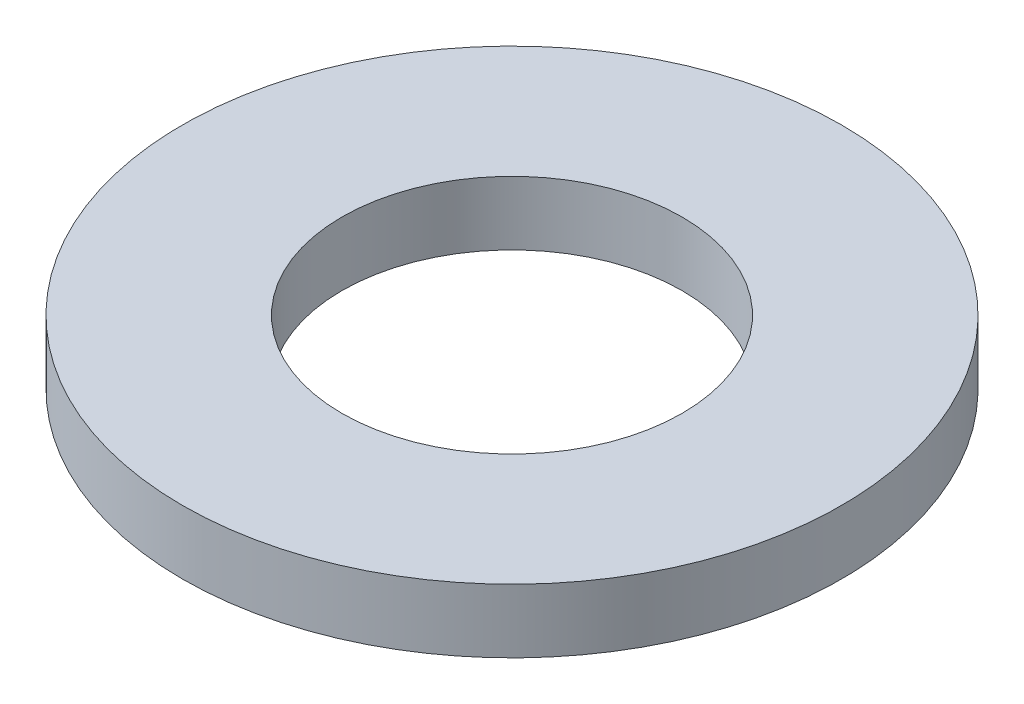
ISO-10303-21;
HEADER;
FILE_DESCRIPTION(('STEP AP214'),'2;1');
FILE_NAME('part.step','',(''),(''),'','','');
FILE_SCHEMA(('AUTOMOTIVE_DESIGN { 1 0 10303 214 1 1 1 1 }'));
ENDSEC;
DATA;
#1=APPLICATION_CONTEXT('core data for automotive mechanical design processes');
#2=APPLICATION_PROTOCOL_DEFINITION('international standard','automotive_design',2000,#1);
#3=PRODUCT_CONTEXT('',#1,'mechanical');
#4=PRODUCT('Part','Part','',(#3));
#5=PRODUCT_RELATED_PRODUCT_CATEGORY('part','',(#4));
#6=PRODUCT_DEFINITION_FORMATION('','',#4);
#7=PRODUCT_DEFINITION_CONTEXT('part definition',#1,'design');
#8=PRODUCT_DEFINITION('design','',#6,#7);
#9=PRODUCT_DEFINITION_SHAPE('','',#8);
#10=(LENGTH_UNIT() NAMED_UNIT(*) SI_UNIT(.MILLI.,.METRE.));
#11=(NAMED_UNIT(*) PLANE_ANGLE_UNIT() SI_UNIT($,.RADIAN.));
#12=(NAMED_UNIT(*) SI_UNIT($,.STERADIAN.) SOLID_ANGLE_UNIT());
#13=UNCERTAINTY_MEASURE_WITH_UNIT(LENGTH_MEASURE(1.E-05),#10,'distance_accuracy_value','');
#14=(GEOMETRIC_REPRESENTATION_CONTEXT(3) GLOBAL_UNCERTAINTY_ASSIGNED_CONTEXT((#13)) GLOBAL_UNIT_ASSIGNED_CONTEXT((#10,
#11,#12)) REPRESENTATION_CONTEXT('',''));
#15=CARTESIAN_POINT('',(0.,0.,0.));
#16=DIRECTION('',(0.,0.,1.));
#17=DIRECTION('',(1.,0.,0.));
#18=AXIS2_PLACEMENT_3D('',#15,#16,#17);
#19=CARTESIAN_POINT('',(0.,15.,0.));
#20=DIRECTION('',(0.,-1.,0.));
#21=DIRECTION('',(0.,0.,-1.));
#22=AXIS2_PLACEMENT_3D('',#19,#20,#21);
#23=CYLINDRICAL_SURFACE('',#22,77.5);
#24=CARTESIAN_POINT('',(0.,15.,0.));
#25=DIRECTION('',(0.,1.,0.));
#26=DIRECTION('',(0.,0.,1.));
#27=AXIS2_PLACEMENT_3D('',#24,#25,#26);
#28=CIRCLE('',#27,77.5);
#29=CARTESIAN_POINT('',(0.,15.,77.5));
#30=VERTEX_POINT('',#29);
#31=EDGE_CURVE('E10',#30,#30,#28,.T.);
#32=ORIENTED_EDGE('',*,*,#31,.F.);
#33=EDGE_LOOP('',(#32));
#34=FACE_BOUND('',#33,.T.);
#35=CARTESIAN_POINT('',(0.,0.,0.));
#36=DIRECTION('',(0.,1.,0.));
#37=DIRECTION('',(0.,0.,1.));
#38=AXIS2_PLACEMENT_3D('',#35,#36,#37);
#39=CIRCLE('',#38,77.5);
#40=CARTESIAN_POINT('',(0.,0.,77.5));
#41=VERTEX_POINT('',#40);
#42=EDGE_CURVE('E37',#41,#41,#39,.T.);
#43=ORIENTED_EDGE('',*,*,#42,.T.);
#44=EDGE_LOOP('',(#43));
#45=FACE_BOUND('',#44,.T.);
#46=ADVANCED_FACE('F40',(#34,#45),#23,.T.);
#47=CARTESIAN_POINT('',(0.,15.,0.));
#48=DIRECTION('',(0.,1.,0.));
#49=DIRECTION('',(0.,0.,1.));
#50=AXIS2_PLACEMENT_3D('',#47,#48,#49);
#51=PLANE('',#50);
#52=CARTESIAN_POINT('',(0.,15.,0.));
#53=DIRECTION('',(0.,1.,0.));
#54=DIRECTION('',(0.,0.,1.));
#55=AXIS2_PLACEMENT_3D('',#52,#53,#54);
#56=CIRCLE('',#55,40.);
#57=CARTESIAN_POINT('',(0.,15.,40.));
#58=VERTEX_POINT('',#57);
#59=EDGE_CURVE('E50',#58,#58,#56,.T.);
#60=ORIENTED_EDGE('',*,*,#59,.F.);
#61=EDGE_LOOP('',(#60));
#62=FACE_BOUND('',#61,.T.);
#63=ORIENTED_EDGE('',*,*,#31,.T.);
#64=EDGE_LOOP('',(#63));
#65=FACE_BOUND('',#64,.T.);
#66=ADVANCED_FACE('F59',(#62,#65),#51,.T.);
#67=CARTESIAN_POINT('',(0.,0.,0.));
#68=DIRECTION('',(0.,1.,0.));
#69=DIRECTION('',(0.,0.,1.));
#70=AXIS2_PLACEMENT_3D('',#67,#68,#69);
#71=PLANE('',#70);
#72=CARTESIAN_POINT('',(0.,0.,0.));
#73=DIRECTION('',(0.,1.,0.));
#74=DIRECTION('',(0.,0.,1.));
#75=AXIS2_PLACEMENT_3D('',#72,#73,#74);
#76=CIRCLE('',#75,40.);
#77=CARTESIAN_POINT('',(0.,0.,40.));
#78=VERTEX_POINT('',#77);
#79=EDGE_CURVE('E47',#78,#78,#76,.T.);
#80=ORIENTED_EDGE('',*,*,#79,.T.);
#81=EDGE_LOOP('',(#80));
#82=FACE_BOUND('',#81,.T.);
#83=ORIENTED_EDGE('',*,*,#42,.F.);
#84=EDGE_LOOP('',(#83));
#85=FACE_BOUND('',#84,.T.);
#86=ADVANCED_FACE('F58',(#82,#85),#71,.F.);
#87=CARTESIAN_POINT('',(0.,15.,0.));
#88=DIRECTION('',(0.,-1.,0.));
#89=DIRECTION('',(0.,0.,-1.));
#90=AXIS2_PLACEMENT_3D('',#87,#88,#89);
#91=CYLINDRICAL_SURFACE('',#90,40.);
#92=ORIENTED_EDGE('',*,*,#59,.T.);
#93=EDGE_LOOP('',(#92));
#94=FACE_BOUND('',#93,.T.);
#95=ORIENTED_EDGE('',*,*,#79,.F.);
#96=EDGE_LOOP('',(#95));
#97=FACE_BOUND('',#96,.T.);
#98=ADVANCED_FACE('F54',(#94,#97),#91,.F.);
#99=CLOSED_SHELL('',(#46,#66,#86,#98));
#100=MANIFOLD_SOLID_BREP('B2',#99);
#101=ADVANCED_BREP_SHAPE_REPRESENTATION('',(#18,#100),#14);
#102=SHAPE_DEFINITION_REPRESENTATION(#9,#101);
ENDSEC;
END-ISO-10303-21;
